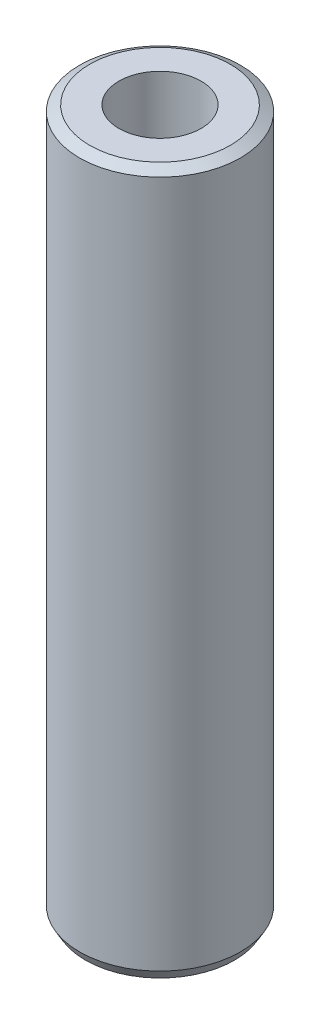
ISO-10303-21;
HEADER;
FILE_DESCRIPTION(('STEP AP214'),'2;1');
FILE_NAME('part.step','',(''),(''),'','','');
FILE_SCHEMA(('AUTOMOTIVE_DESIGN { 1 0 10303 214 1 1 1 1 }'));
ENDSEC;
DATA;
#1=APPLICATION_CONTEXT('core data for automotive mechanical design processes');
#2=APPLICATION_PROTOCOL_DEFINITION('international standard','automotive_design',2000,#1);
#3=PRODUCT_CONTEXT('',#1,'mechanical');
#4=PRODUCT('Part','Part','',(#3));
#5=PRODUCT_RELATED_PRODUCT_CATEGORY('part','',(#4));
#6=PRODUCT_DEFINITION_FORMATION('','',#4);
#7=PRODUCT_DEFINITION_CONTEXT('part definition',#1,'design');
#8=PRODUCT_DEFINITION('design','',#6,#7);
#9=PRODUCT_DEFINITION_SHAPE('','',#8);
#10=(LENGTH_UNIT() NAMED_UNIT(*) SI_UNIT(.MILLI.,.METRE.));
#11=(NAMED_UNIT(*) PLANE_ANGLE_UNIT() SI_UNIT($,.RADIAN.));
#12=(NAMED_UNIT(*) SI_UNIT($,.STERADIAN.) SOLID_ANGLE_UNIT());
#13=UNCERTAINTY_MEASURE_WITH_UNIT(LENGTH_MEASURE(1.E-05),#10,'distance_accuracy_value','');
#14=(GEOMETRIC_REPRESENTATION_CONTEXT(3) GLOBAL_UNCERTAINTY_ASSIGNED_CONTEXT((#13)) GLOBAL_UNIT_ASSIGNED_CONTEXT((#10,
#11,#12)) REPRESENTATION_CONTEXT('',''));
#15=CARTESIAN_POINT('',(0.,0.,0.));
#16=DIRECTION('',(0.,0.,1.));
#17=DIRECTION('',(1.,0.,0.));
#18=AXIS2_PLACEMENT_3D('',#15,#16,#17);
#19=CARTESIAN_POINT('',(0.,328.050613928959,0.));
#20=DIRECTION('',(0.,-1.,0.));
#21=DIRECTION('',(0.,0.,-1.));
#22=AXIS2_PLACEMENT_3D('',#19,#20,#21);
#23=CYLINDRICAL_SURFACE('',#22,37.5);
#24=CARTESIAN_POINT('',(0.,325.324833394398,0.));
#25=DIRECTION('',(0.,1.,0.));
#26=DIRECTION('',(0.,0.,1.));
#27=AXIS2_PLACEMENT_3D('',#24,#25,#26);
#28=CIRCLE('',#27,37.5);
#29=CARTESIAN_POINT('',(0.,325.324833394398,37.5));
#30=VERTEX_POINT('',#29);
#31=EDGE_CURVE('E50',#30,#30,#28,.F.);
#32=ORIENTED_EDGE('',*,*,#31,.T.);
#33=EDGE_LOOP('',(#32));
#34=FACE_BOUND('',#33,.T.);
#35=CARTESIAN_POINT('',(0.,4.72119037614072,0.));
#36=DIRECTION('',(0.,1.,0.));
#37=DIRECTION('',(0.,0.,1.));
#38=AXIS2_PLACEMENT_3D('',#35,#36,#37);
#39=CIRCLE('',#38,37.5);
#40=CARTESIAN_POINT('',(0.,4.72119037614072,37.5));
#41=VERTEX_POINT('',#40);
#42=EDGE_CURVE('E51',#41,#41,#39,.T.);
#43=ORIENTED_EDGE('',*,*,#42,.T.);
#44=EDGE_LOOP('',(#43));
#45=FACE_BOUND('',#44,.T.);
#46=ADVANCED_FACE('F39',(#34,#45),#23,.T.);
#47=CARTESIAN_POINT('',(0.,328.050613928959,0.));
#48=DIRECTION('',(0.,1.,0.));
#49=DIRECTION('',(0.,0.,1.));
#50=AXIS2_PLACEMENT_3D('',#47,#48,#49);
#51=PLANE('',#50);
#52=CARTESIAN_POINT('',(0.,328.050613928959,0.));
#53=DIRECTION('',(0.,1.,0.));
#54=DIRECTION('',(0.,0.,1.));
#55=AXIS2_PLACEMENT_3D('',#52,#53,#54);
#56=CIRCLE('',#55,32.7788096238592);
#57=CARTESIAN_POINT('',(0.,328.050613928959,32.7788096238592));
#58=VERTEX_POINT('',#57);
#59=EDGE_CURVE('E54',#58,#58,#56,.T.);
#60=ORIENTED_EDGE('',*,*,#59,.T.);
#61=EDGE_LOOP('',(#60));
#62=FACE_BOUND('',#61,.T.);
#63=CARTESIAN_POINT('',(0.,328.050613928959,0.));
#64=DIRECTION('',(0.,1.,0.));
#65=DIRECTION('',(0.,0.,1.));
#66=AXIS2_PLACEMENT_3D('',#63,#64,#65);
#67=CIRCLE('',#66,19.1573405220897);
#68=CARTESIAN_POINT('',(0.,328.050613928959,19.1573405220897));
#69=VERTEX_POINT('',#68);
#70=EDGE_CURVE('E58',#69,#69,#67,.T.);
#71=ORIENTED_EDGE('',*,*,#70,.F.);
#72=EDGE_LOOP('',(#71));
#73=FACE_BOUND('',#72,.T.);
#74=ADVANCED_FACE('F69',(#62,#73),#51,.T.);
#75=CARTESIAN_POINT('',(0.,0.,0.));
#76=DIRECTION('',(0.,1.,0.));
#77=DIRECTION('',(0.,0.,1.));
#78=AXIS2_PLACEMENT_3D('',#75,#76,#77);
#79=PLANE('',#78);
#80=CARTESIAN_POINT('',(0.,0.,0.));
#81=DIRECTION('',(0.,1.,0.));
#82=DIRECTION('',(0.,0.,1.));
#83=AXIS2_PLACEMENT_3D('',#80,#81,#82);
#84=CIRCLE('',#83,34.7742194654397);
#85=CARTESIAN_POINT('',(0.,0.,34.7742194654397));
#86=VERTEX_POINT('',#85);
#87=EDGE_CURVE('E10',#86,#86,#84,.F.);
#88=ORIENTED_EDGE('',*,*,#87,.T.);
#89=EDGE_LOOP('',(#88));
#90=FACE_BOUND('',#89,.T.);
#91=CARTESIAN_POINT('',(0.,0.,0.));
#92=DIRECTION('',(0.,1.,0.));
#93=DIRECTION('',(0.,0.,1.));
#94=AXIS2_PLACEMENT_3D('',#91,#92,#93);
#95=CIRCLE('',#94,19.1573405220897);
#96=CARTESIAN_POINT('',(0.,0.,19.1573405220897));
#97=VERTEX_POINT('',#96);
#98=EDGE_CURVE('E63',#97,#97,#95,.T.);
#99=ORIENTED_EDGE('',*,*,#98,.T.);
#100=EDGE_LOOP('',(#99));
#101=FACE_BOUND('',#100,.T.);
#102=ADVANCED_FACE('F75',(#90,#101),#79,.F.);
#103=CARTESIAN_POINT('',(0.,328.050613928959,0.));
#104=DIRECTION('',(0.,-1.,0.));
#105=DIRECTION('',(0.,0.,-1.));
#106=AXIS2_PLACEMENT_3D('',#103,#104,#105);
#107=CYLINDRICAL_SURFACE('',#106,19.1573405220897);
#108=ORIENTED_EDGE('',*,*,#70,.T.);
#109=EDGE_LOOP('',(#108));
#110=FACE_BOUND('',#109,.T.);
#111=ORIENTED_EDGE('',*,*,#98,.F.);
#112=EDGE_LOOP('',(#111));
#113=FACE_BOUND('',#112,.T.);
#114=ADVANCED_FACE('F70',(#110,#113),#107,.F.);
#115=CARTESIAN_POINT('',(0.,328.050613928959,0.));
#116=DIRECTION('',(0.,-1.,0.));
#117=DIRECTION('',(0.,0.,-1.));
#118=AXIS2_PLACEMENT_3D('',#115,#116,#117);
#119=CONICAL_SURFACE('',#118,32.7788096238592,1.0471975511966);
#120=ORIENTED_EDGE('',*,*,#31,.F.);
#121=EDGE_LOOP('',(#120));
#122=FACE_BOUND('',#121,.T.);
#123=ORIENTED_EDGE('',*,*,#59,.F.);
#124=EDGE_LOOP('',(#123));
#125=FACE_BOUND('',#124,.T.);
#126=ADVANCED_FACE('F81',(#122,#125),#119,.T.);
#127=CARTESIAN_POINT('',(0.,4.72119037614072,0.));
#128=DIRECTION('',(0.,1.,0.));
#129=DIRECTION('',(0.,0.,1.));
#130=AXIS2_PLACEMENT_3D('',#127,#128,#129);
#131=CONICAL_SURFACE('',#130,37.5,0.523598775598301);
#132=ORIENTED_EDGE('',*,*,#87,.F.);
#133=EDGE_LOOP('',(#132));
#134=FACE_BOUND('',#133,.T.);
#135=ORIENTED_EDGE('',*,*,#42,.F.);
#136=EDGE_LOOP('',(#135));
#137=FACE_BOUND('',#136,.T.);
#138=ADVANCED_FACE('F45',(#134,#137),#131,.T.);
#139=CLOSED_SHELL('',(#46,#74,#102,#114,#126,#138));
#140=MANIFOLD_SOLID_BREP('B2',#139);
#141=ADVANCED_BREP_SHAPE_REPRESENTATION('',(#18,#140),#14);
#142=SHAPE_DEFINITION_REPRESENTATION(#9,#141);
ENDSEC;
END-ISO-10303-21;
